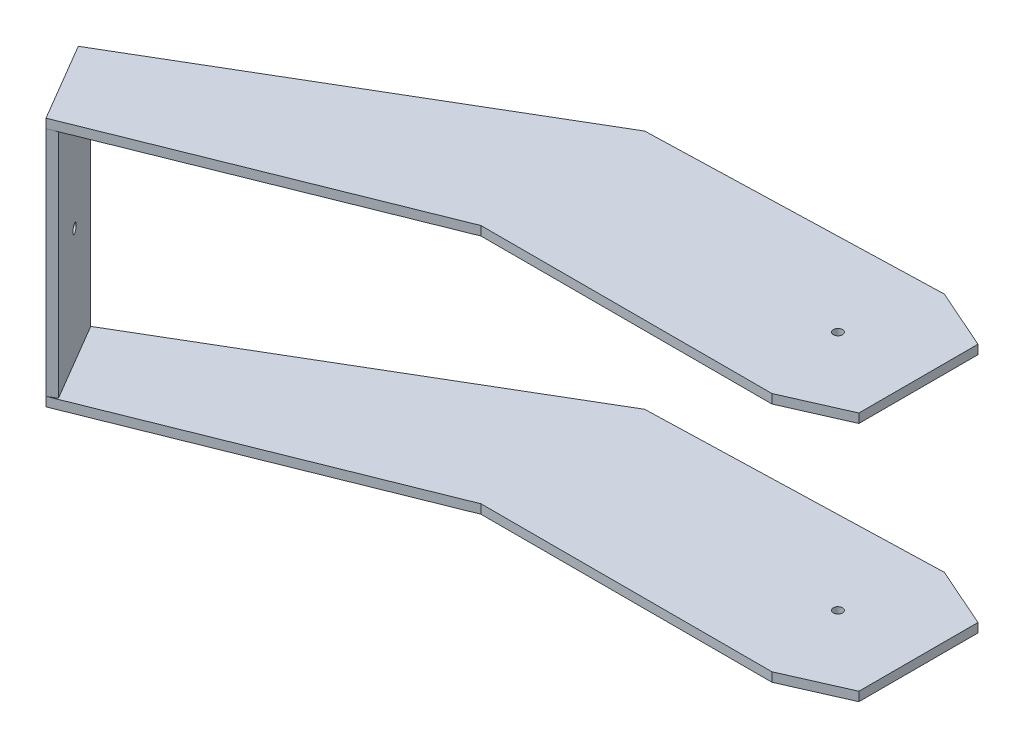
ISO-10303-21;
HEADER;
FILE_DESCRIPTION(('STEP AP214'),'2;1');
FILE_NAME('part.step','',(''),(''),'','','');
FILE_SCHEMA(('AUTOMOTIVE_DESIGN { 1 0 10303 214 1 1 1 1 }'));
ENDSEC;
DATA;
#1=APPLICATION_CONTEXT('core data for automotive mechanical design processes');
#2=APPLICATION_PROTOCOL_DEFINITION('international standard','automotive_design',2000,#1);
#3=PRODUCT_CONTEXT('',#1,'mechanical');
#4=PRODUCT('Part','Part','',(#3));
#5=PRODUCT_RELATED_PRODUCT_CATEGORY('part','',(#4));
#6=PRODUCT_DEFINITION_FORMATION('','',#4);
#7=PRODUCT_DEFINITION_CONTEXT('part definition',#1,'design');
#8=PRODUCT_DEFINITION('design','',#6,#7);
#9=PRODUCT_DEFINITION_SHAPE('','',#8);
#10=(LENGTH_UNIT() NAMED_UNIT(*) SI_UNIT(.MILLI.,.METRE.));
#11=(NAMED_UNIT(*) PLANE_ANGLE_UNIT() SI_UNIT($,.RADIAN.));
#12=(NAMED_UNIT(*) SI_UNIT($,.STERADIAN.) SOLID_ANGLE_UNIT());
#13=UNCERTAINTY_MEASURE_WITH_UNIT(LENGTH_MEASURE(1.E-05),#10,'distance_accuracy_value','');
#14=(GEOMETRIC_REPRESENTATION_CONTEXT(3) GLOBAL_UNCERTAINTY_ASSIGNED_CONTEXT((#13)) GLOBAL_UNIT_ASSIGNED_CONTEXT((#10,
#11,#12)) REPRESENTATION_CONTEXT('',''));
#15=CARTESIAN_POINT('',(0.,0.,0.));
#16=DIRECTION('',(0.,0.,1.));
#17=DIRECTION('',(1.,0.,0.));
#18=AXIS2_PLACEMENT_3D('',#15,#16,#17);
#19=CARTESIAN_POINT('',(0.,23.5,0.));
#20=DIRECTION('',(0.,0.,-1.));
#21=DIRECTION('',(-1.,0.,0.));
#22=AXIS2_PLACEMENT_3D('',#19,#20,#21);
#23=PLANE('',#22);
#24=DIRECTION('',(-1.,0.,0.));
#25=VECTOR('',#24,1.);
#26=CARTESIAN_POINT('',(0.,25.5,0.));
#27=LINE('',#26,#25);
#28=CARTESIAN_POINT('',(0.,25.5,0.));
#29=VERTEX_POINT('',#28);
#30=CARTESIAN_POINT('',(-64.,25.5000000000004,0.));
#31=VERTEX_POINT('',#30);
#32=EDGE_CURVE('E276',#29,#31,#27,.T.);
#33=ORIENTED_EDGE('',*,*,#32,.T.);
#34=DIRECTION('',(0.,1.,0.));
#35=VECTOR('',#34,1.);
#36=CARTESIAN_POINT('',(-64.,23.5000000000004,0.));
#37=LINE('',#36,#35);
#38=CARTESIAN_POINT('',(-64.,23.5000000000004,0.));
#39=VERTEX_POINT('',#38);
#40=EDGE_CURVE('E46',#39,#31,#37,.T.);
#41=ORIENTED_EDGE('',*,*,#40,.F.);
#42=DIRECTION('',(-1.,0.,0.));
#43=VECTOR('',#42,1.);
#44=CARTESIAN_POINT('',(0.,23.5,0.));
#45=LINE('',#44,#43);
#46=CARTESIAN_POINT('',(0.,23.5,0.));
#47=VERTEX_POINT('',#46);
#48=EDGE_CURVE('E280',#47,#39,#45,.T.);
#49=ORIENTED_EDGE('',*,*,#48,.F.);
#50=DIRECTION('',(0.,1.,0.));
#51=VECTOR('',#50,1.);
#52=CARTESIAN_POINT('',(0.,23.5,0.));
#53=LINE('',#52,#51);
#54=EDGE_CURVE('E304',#47,#29,#53,.T.);
#55=ORIENTED_EDGE('',*,*,#54,.T.);
#56=EDGE_LOOP('',(#33,#41,#49,#55));
#57=FACE_BOUND('',#56,.T.);
#58=ADVANCED_FACE('F38',(#57),#23,.F.);
#59=CARTESIAN_POINT('',(-132.293984031114,23.5000000000009,27.3792690487822));
#60=DIRECTION('',(-0.372113179659654,0.,-0.928187363372063));
#61=DIRECTION('',(-0.928187363372063,0.,0.372113179659654));
#62=AXIS2_PLACEMENT_3D('',#59,#60,#61);
#63=PLANE('',#62);
#64=DIRECTION('',(-0.928187363372063,0.,0.372113179659654));
#65=VECTOR('',#64,1.);
#66=CARTESIAN_POINT('',(-132.293984031114,25.5000000000009,27.3792690487822));
#67=LINE('',#66,#65);
#68=CARTESIAN_POINT('',(-132.293984031114,25.5000000000009,27.3792690487822));
#69=VERTEX_POINT('',#68);
#70=EDGE_CURVE('E308',#31,#69,#67,.T.);
#71=ORIENTED_EDGE('',*,*,#70,.T.);
#72=DIRECTION('',(0.,1.,0.));
#73=VECTOR('',#72,1.);
#74=CARTESIAN_POINT('',(-132.293984031114,23.5000000000009,27.3792690487822));
#75=LINE('',#74,#73);
#76=CARTESIAN_POINT('',(-132.293984031114,23.5000000000009,27.3792690487822));
#77=VERTEX_POINT('',#76);
#78=EDGE_CURVE('E351',#77,#69,#75,.T.);
#79=ORIENTED_EDGE('',*,*,#78,.F.);
#80=DIRECTION('',(-0.928187363372063,0.,0.372113179659654));
#81=VECTOR('',#80,1.);
#82=CARTESIAN_POINT('',(-132.293984031114,23.5000000000009,27.3792690487822));
#83=LINE('',#82,#81);
#84=EDGE_CURVE('E284',#39,#77,#83,.T.);
#85=ORIENTED_EDGE('',*,*,#84,.F.);
#86=ORIENTED_EDGE('',*,*,#40,.T.);
#87=EDGE_LOOP('',(#71,#79,#85,#86));
#88=FACE_BOUND('',#87,.T.);
#89=ADVANCED_FACE('F358',(#88),#63,.F.);
#90=CARTESIAN_POINT('',(-132.293984031114,23.5000000000009,27.3792690487822));
#91=DIRECTION('',(0.861921198917986,0.,-0.507042253521125));
#92=DIRECTION('',(-0.507042253521125,0.,-0.861921198917986));
#93=AXIS2_PLACEMENT_3D('',#90,#91,#92);
#94=PLANE('',#93);
#95=CARTESIAN_POINT('',(-137.364406566326,-1.99999999999904,18.7600570596024));
#96=DIRECTION('',(-0.861921198917986,0.,0.507042253521125));
#97=DIRECTION('',(0.507042253521126,0.,0.861921198917986));
#98=AXIS2_PLACEMENT_3D('',#95,#96,#97);
#99=CIRCLE('',#98,1.);
#100=CARTESIAN_POINT('',(-136.857364312805,-1.99999999999904,19.6219782585204));
#101=VERTEX_POINT('',#100);
#102=EDGE_CURVE('E597',#101,#101,#99,.T.);
#103=ORIENTED_EDGE('',*,*,#102,.F.);
#104=EDGE_LOOP('',(#103));
#105=FACE_BOUND('',#104,.T.);
#106=DIRECTION('',(-0.507042253521125,0.,-0.861921198917986));
#107=VECTOR('',#106,1.);
#108=CARTESIAN_POINT('',(-132.293984031114,25.5000000000009,27.3792690487822));
#109=LINE('',#108,#107);
#110=CARTESIAN_POINT('',(-142.434829101537,25.500000000001,10.1408450704225));
#111=VERTEX_POINT('',#110);
#112=EDGE_CURVE('E311',#69,#111,#109,.T.);
#113=ORIENTED_EDGE('',*,*,#112,.T.);
#114=DIRECTION('',(0.,1.,0.));
#115=VECTOR('',#114,1.);
#116=CARTESIAN_POINT('',(-142.434829101537,23.500000000001,10.1408450704225));
#117=LINE('',#116,#115);
#118=CARTESIAN_POINT('',(-142.434829101537,-29.499999999999,10.1408450704226));
#119=VERTEX_POINT('',#118);
#120=EDGE_CURVE('E348',#119,#111,#117,.T.);
#121=ORIENTED_EDGE('',*,*,#120,.F.);
#122=DIRECTION('',(0.507042253521125,0.,0.861921198917986));
#123=VECTOR('',#122,1.);
#124=CARTESIAN_POINT('',(-142.434829101537,-29.499999999999,10.1408450704226));
#125=LINE('',#124,#123);
#126=CARTESIAN_POINT('',(-132.293984031115,-29.4999999999991,27.3792690487823));
#127=VERTEX_POINT('',#126);
#128=EDGE_CURVE('E247',#119,#127,#125,.T.);
#129=ORIENTED_EDGE('',*,*,#128,.T.);
#130=DIRECTION('',(0.,1.,0.));
#131=VECTOR('',#130,1.);
#132=CARTESIAN_POINT('',(-132.293984031114,25.5000000000009,27.3792690487823));
#133=LINE('',#132,#131);
#134=CARTESIAN_POINT('',(-132.293984031115,-27.4999999999991,27.3792690487823));
#135=VERTEX_POINT('',#134);
#136=EDGE_CURVE('E252',#127,#135,#133,.T.);
#137=ORIENTED_EDGE('',*,*,#136,.T.);
#138=EDGE_CURVE('E259',#135,#77,#133,.T.);
#139=ORIENTED_EDGE('',*,*,#138,.T.);
#140=ORIENTED_EDGE('',*,*,#78,.T.);
#141=EDGE_LOOP('',(#113,#121,#129,#137,#139,#140));
#142=FACE_BOUND('',#141,.T.);
#143=ADVANCED_FACE('F373',(#105,#142),#94,.F.);
#144=CARTESIAN_POINT('',(-64.,23.5000000000004,-36.));
#145=DIRECTION('',(0.507042253521127,0.,0.861921198917985));
#146=DIRECTION('',(0.861921198917986,0.,-0.507042253521127));
#147=AXIS2_PLACEMENT_3D('',#144,#145,#146);
#148=PLANE('',#147);
#149=DIRECTION('',(0.,-1.,0.));
#150=VECTOR('',#149,1.);
#151=CARTESIAN_POINT('',(-140.710986703701,25.500000000001,9.12676056338031));
#152=LINE('',#151,#150);
#153=CARTESIAN_POINT('',(-140.710986703701,23.500000000001,9.12676056338032));
#154=VERTEX_POINT('',#153);
#155=CARTESIAN_POINT('',(-140.710986703701,-27.499999999999,9.12676056338031));
#156=VERTEX_POINT('',#155);
#157=EDGE_CURVE('E248',#154,#156,#152,.T.);
#158=ORIENTED_EDGE('',*,*,#157,.T.);
#159=DIRECTION('',(0.861921198917985,0.,-0.507042253521127));
#160=VECTOR('',#159,1.);
#161=CARTESIAN_POINT('',(-64.0000000000006,-27.4999999999996,-35.9999999999999));
#162=LINE('',#161,#160);
#163=CARTESIAN_POINT('',(-64.0000000000006,-27.4999999999996,-35.9999999999999));
#164=VERTEX_POINT('',#163);
#165=EDGE_CURVE('E171',#156,#164,#162,.T.);
#166=ORIENTED_EDGE('',*,*,#165,.T.);
#167=DIRECTION('',(0.,-1.,0.));
#168=VECTOR('',#167,1.);
#169=CARTESIAN_POINT('',(-64.0000000000006,-27.4999999999996,-35.9999999999999));
#170=LINE('',#169,#168);
#171=CARTESIAN_POINT('',(-64.0000000000006,-29.4999999999996,-35.9999999999999));
#172=VERTEX_POINT('',#171);
#173=EDGE_CURVE('E186',#164,#172,#170,.T.);
#174=ORIENTED_EDGE('',*,*,#173,.T.);
#175=DIRECTION('',(-0.861921198917986,0.,0.507042253521126));
#176=VECTOR('',#175,1.);
#177=CARTESIAN_POINT('',(-140.710986703701,-29.499999999999,9.12676056338031));
#178=LINE('',#177,#176);
#179=EDGE_CURVE('E255',#172,#119,#178,.T.);
#180=ORIENTED_EDGE('',*,*,#179,.T.);
#181=ORIENTED_EDGE('',*,*,#120,.T.);
#182=DIRECTION('',(0.861921198917985,0.,-0.507042253521127));
#183=VECTOR('',#182,1.);
#184=CARTESIAN_POINT('',(-64.,25.5000000000004,-36.));
#185=LINE('',#184,#183);
#186=CARTESIAN_POINT('',(-64.,25.5000000000004,-36.));
#187=VERTEX_POINT('',#186);
#188=EDGE_CURVE('E315',#111,#187,#185,.T.);
#189=ORIENTED_EDGE('',*,*,#188,.T.);
#190=DIRECTION('',(0.,1.,0.));
#191=VECTOR('',#190,1.);
#192=CARTESIAN_POINT('',(-64.,23.5000000000004,-36.));
#193=LINE('',#192,#191);
#194=CARTESIAN_POINT('',(-64.,23.5000000000004,-36.));
#195=VERTEX_POINT('',#194);
#196=EDGE_CURVE('E344',#195,#187,#193,.T.);
#197=ORIENTED_EDGE('',*,*,#196,.F.);
#198=DIRECTION('',(0.861921198917985,0.,-0.507042253521127));
#199=VECTOR('',#198,1.);
#200=CARTESIAN_POINT('',(-64.,23.5000000000004,-36.));
#201=LINE('',#200,#199);
#202=EDGE_CURVE('E289',#154,#195,#201,.T.);
#203=ORIENTED_EDGE('',*,*,#202,.F.);
#204=EDGE_LOOP('',(#158,#166,#174,#180,#181,#189,#197,#203));
#205=FACE_BOUND('',#204,.T.);
#206=ADVANCED_FACE('F381',(#205),#148,.F.);
#207=CARTESIAN_POINT('',(0.,23.5,-37.9064407956823));
#208=DIRECTION('',(0.0297749302206453,0.,0.999556628476024));
#209=DIRECTION('',(0.999556628476024,0.,-0.0297749302206453));
#210=AXIS2_PLACEMENT_3D('',#207,#208,#209);
#211=PLANE('',#210);
#212=DIRECTION('',(0.999556628476024,0.,-0.0297749302206453));
#213=VECTOR('',#212,1.);
#214=CARTESIAN_POINT('',(0.,25.5,-37.9064407956823));
#215=LINE('',#214,#213);
#216=CARTESIAN_POINT('',(0.,25.5,-37.9064407956823));
#217=VERTEX_POINT('',#216);
#218=EDGE_CURVE('E318',#187,#217,#215,.T.);
#219=ORIENTED_EDGE('',*,*,#218,.T.);
#220=DIRECTION('',(0.,1.,0.));
#221=VECTOR('',#220,1.);
#222=CARTESIAN_POINT('',(0.,23.5,-37.9064407956823));
#223=LINE('',#222,#221);
#224=CARTESIAN_POINT('',(0.,23.5,-37.9064407956823));
#225=VERTEX_POINT('',#224);
#226=EDGE_CURVE('E340',#225,#217,#223,.T.);
#227=ORIENTED_EDGE('',*,*,#226,.F.);
#228=DIRECTION('',(0.999556628476024,0.,-0.0297749302206453));
#229=VECTOR('',#228,1.);
#230=CARTESIAN_POINT('',(0.,23.5,-37.9064407956823));
#231=LINE('',#230,#229);
#232=EDGE_CURVE('E292',#195,#225,#231,.T.);
#233=ORIENTED_EDGE('',*,*,#232,.F.);
#234=ORIENTED_EDGE('',*,*,#196,.T.);
#235=EDGE_LOOP('',(#219,#227,#233,#234));
#236=FACE_BOUND('',#235,.T.);
#237=ADVANCED_FACE('F388',(#236),#211,.F.);
#238=CARTESIAN_POINT('',(0.,23.5,-37.9064407956823));
#239=DIRECTION('',(-0.403577522554237,0.,0.914945453723327));
#240=DIRECTION('',(0.914945453723327,0.,0.403577522554237));
#241=AXIS2_PLACEMENT_3D('',#238,#239,#240);
#242=PLANE('',#241);
#243=DIRECTION('',(0.914945453723327,0.,0.403577522554237));
#244=VECTOR('',#243,1.);
#245=CARTESIAN_POINT('',(0.,25.5,-37.9064407956823));
#246=LINE('',#245,#244);
#247=CARTESIAN_POINT('',(13.2667090789882,25.4999999999999,-32.0545667186458));
#248=VERTEX_POINT('',#247);
#249=EDGE_CURVE('E321',#217,#248,#246,.T.);
#250=ORIENTED_EDGE('',*,*,#249,.T.);
#251=DIRECTION('',(0.,1.,0.));
#252=VECTOR('',#251,1.);
#253=CARTESIAN_POINT('',(13.2667090789882,23.4999999999999,-32.0545667186458));
#254=LINE('',#253,#252);
#255=CARTESIAN_POINT('',(13.2667090789882,23.4999999999999,-32.0545667186458));
#256=VERTEX_POINT('',#255);
#257=EDGE_CURVE('E336',#256,#248,#254,.T.);
#258=ORIENTED_EDGE('',*,*,#257,.F.);
#259=DIRECTION('',(0.914945453723327,0.,0.403577522554237));
#260=VECTOR('',#259,1.);
#261=CARTESIAN_POINT('',(0.,23.5,-37.9064407956823));
#262=LINE('',#261,#260);
#263=EDGE_CURVE('E295',#225,#256,#262,.T.);
#264=ORIENTED_EDGE('',*,*,#263,.F.);
#265=ORIENTED_EDGE('',*,*,#226,.T.);
#266=EDGE_LOOP('',(#250,#258,#264,#265));
#267=FACE_BOUND('',#266,.T.);
#268=ADVANCED_FACE('F391',(#267),#242,.F.);
#269=CARTESIAN_POINT('',(13.2667090789882,23.4999999999999,-32.0545667186458));
#270=DIRECTION('',(-1.,0.,0.));
#271=DIRECTION('',(0.,-1.,0.));
#272=AXIS2_PLACEMENT_3D('',#269,#270,#271);
#273=PLANE('',#272);
#274=DIRECTION('',(0.,0.,1.));
#275=VECTOR('',#274,1.);
#276=CARTESIAN_POINT('',(13.2667090789882,25.4999999999999,-32.0545667186458));
#277=LINE('',#276,#275);
#278=CARTESIAN_POINT('',(13.2667090789882,25.4999999999999,-5.85187407703645));
#279=VERTEX_POINT('',#278);
#280=EDGE_CURVE('E324',#248,#279,#277,.T.);
#281=ORIENTED_EDGE('',*,*,#280,.T.);
#282=DIRECTION('',(0.,1.,0.));
#283=VECTOR('',#282,1.);
#284=CARTESIAN_POINT('',(13.2667090789882,23.4999999999999,-5.85187407703645));
#285=LINE('',#284,#283);
#286=CARTESIAN_POINT('',(13.2667090789882,23.4999999999999,-5.85187407703645));
#287=VERTEX_POINT('',#286);
#288=EDGE_CURVE('E332',#287,#279,#285,.T.);
#289=ORIENTED_EDGE('',*,*,#288,.F.);
#290=DIRECTION('',(0.,0.,1.));
#291=VECTOR('',#290,1.);
#292=CARTESIAN_POINT('',(13.2667090789882,23.4999999999999,-32.0545667186458));
#293=LINE('',#292,#291);
#294=EDGE_CURVE('E298',#256,#287,#293,.T.);
#295=ORIENTED_EDGE('',*,*,#294,.F.);
#296=ORIENTED_EDGE('',*,*,#257,.T.);
#297=EDGE_LOOP('',(#281,#289,#295,#296));
#298=FACE_BOUND('',#297,.T.);
#299=ADVANCED_FACE('F395',(#298),#273,.F.);
#300=CARTESIAN_POINT('',(0.,23.5,0.));
#301=DIRECTION('',(-0.403577522554238,0.,-0.914945453723326));
#302=DIRECTION('',(-0.914945453723326,0.,0.403577522554238));
#303=AXIS2_PLACEMENT_3D('',#300,#301,#302);
#304=PLANE('',#303);
#305=DIRECTION('',(-0.914945453723326,0.,0.403577522554238));
#306=VECTOR('',#305,1.);
#307=CARTESIAN_POINT('',(0.,25.5,0.));
#308=LINE('',#307,#306);
#309=EDGE_CURVE('E285',#279,#29,#308,.T.);
#310=ORIENTED_EDGE('',*,*,#309,.T.);
#311=ORIENTED_EDGE('',*,*,#54,.F.);
#312=DIRECTION('',(-0.914945453723326,0.,0.403577522554238));
#313=VECTOR('',#312,1.);
#314=CARTESIAN_POINT('',(0.,23.5,0.));
#315=LINE('',#314,#313);
#316=EDGE_CURVE('E301',#287,#47,#315,.T.);
#317=ORIENTED_EDGE('',*,*,#316,.F.);
#318=ORIENTED_EDGE('',*,*,#288,.T.);
#319=EDGE_LOOP('',(#310,#311,#317,#318));
#320=FACE_BOUND('',#319,.T.);
#321=ADVANCED_FACE('F398',(#320),#304,.F.);
#322=CARTESIAN_POINT('',(1.64358226964181E-13,23.5,0.));
#323=DIRECTION('',(0.,1.,0.));
#324=DIRECTION('',(-1.,0.,0.));
#325=AXIS2_PLACEMENT_3D('',#322,#323,#324);
#326=PLANE('',#325);
#327=CARTESIAN_POINT('',(-4.43329092101178,23.5,-18.9532203978411));
#328=DIRECTION('',(0.,-1.,0.));
#329=DIRECTION('',(1.,0.,0.));
#330=AXIS2_PLACEMENT_3D('',#327,#328,#329);
#331=CIRCLE('',#330,1.);
#332=CARTESIAN_POINT('',(-3.43329092101178,23.5,-18.9532203978411));
#333=VERTEX_POINT('',#332);
#334=EDGE_CURVE('E272',#333,#333,#331,.T.);
#335=ORIENTED_EDGE('',*,*,#334,.F.);
#336=EDGE_LOOP('',(#335));
#337=FACE_BOUND('',#336,.T.);
#338=ORIENTED_EDGE('',*,*,#84,.T.);
#339=DIRECTION('',(0.861921198917986,0.,-0.507042253521125));
#340=VECTOR('',#339,1.);
#341=CARTESIAN_POINT('',(-22.0461299423995,23.5000000000002,-37.4762194264805));
#342=LINE('',#341,#340);
#343=CARTESIAN_POINT('',(-130.570141633278,23.5000000000009,26.36518454174));
#344=VERTEX_POINT('',#343);
#345=EDGE_CURVE('E268',#77,#344,#342,.T.);
#346=ORIENTED_EDGE('',*,*,#345,.T.);
#347=DIRECTION('',(0.507042253521125,0.,0.861921198917986));
#348=VECTOR('',#347,1.);
#349=CARTESIAN_POINT('',(-108.524011690879,23.5000000000008,63.8414039682205));
#350=LINE('',#349,#348);
#351=EDGE_CURVE('E60',#154,#344,#350,.T.);
#352=ORIENTED_EDGE('',*,*,#351,.F.);
#353=ORIENTED_EDGE('',*,*,#202,.T.);
#354=ORIENTED_EDGE('',*,*,#232,.T.);
#355=ORIENTED_EDGE('',*,*,#263,.T.);
#356=ORIENTED_EDGE('',*,*,#294,.T.);
#357=ORIENTED_EDGE('',*,*,#316,.T.);
#358=ORIENTED_EDGE('',*,*,#48,.T.);
#359=EDGE_LOOP('',(#338,#346,#352,#353,#354,#355,#356,#357,#358));
#360=FACE_BOUND('',#359,.T.);
#361=ADVANCED_FACE('F376',(#337,#360),#326,.F.);
#362=CARTESIAN_POINT('',(1.78324152319553E-13,25.5,0.));
#363=DIRECTION('',(0.,1.,0.));
#364=DIRECTION('',(-1.,0.,0.));
#365=AXIS2_PLACEMENT_3D('',#362,#363,#364);
#366=PLANE('',#365);
#367=ORIENTED_EDGE('',*,*,#112,.F.);
#368=ORIENTED_EDGE('',*,*,#70,.F.);
#369=ORIENTED_EDGE('',*,*,#32,.F.);
#370=ORIENTED_EDGE('',*,*,#309,.F.);
#371=ORIENTED_EDGE('',*,*,#280,.F.);
#372=ORIENTED_EDGE('',*,*,#249,.F.);
#373=ORIENTED_EDGE('',*,*,#218,.F.);
#374=ORIENTED_EDGE('',*,*,#188,.F.);
#375=EDGE_LOOP('',(#367,#368,#369,#370,#371,#372,#373,#374));
#376=FACE_BOUND('',#375,.T.);
#377=CARTESIAN_POINT('',(-4.43329092101176,25.5,-18.9532203978411));
#378=DIRECTION('',(0.,-1.,0.));
#379=DIRECTION('',(1.,0.,0.));
#380=AXIS2_PLACEMENT_3D('',#377,#378,#379);
#381=CIRCLE('',#380,1.);
#382=CARTESIAN_POINT('',(-3.43329092101176,25.5,-18.9532203978411));
#383=VERTEX_POINT('',#382);
#384=EDGE_CURVE('E271',#383,#383,#381,.T.);
#385=ORIENTED_EDGE('',*,*,#384,.T.);
#386=EDGE_LOOP('',(#385));
#387=FACE_BOUND('',#386,.T.);
#388=ADVANCED_FACE('F367',(#376,#387),#366,.T.);
#389=CARTESIAN_POINT('',(-4.43329092101178,23.5,-18.9532203978411));
#390=DIRECTION('',(0.,1.,0.));
#391=DIRECTION('',(-1.,0.,0.));
#392=AXIS2_PLACEMENT_3D('',#389,#390,#391);
#393=CYLINDRICAL_SURFACE('',#392,1.);
#394=ORIENTED_EDGE('',*,*,#334,.T.);
#395=EDGE_LOOP('',(#394));
#396=FACE_BOUND('',#395,.T.);
#397=ORIENTED_EDGE('',*,*,#384,.F.);
#398=EDGE_LOOP('',(#397));
#399=FACE_BOUND('',#398,.T.);
#400=ADVANCED_FACE('F443',(#396,#399),#393,.F.);
#401=CARTESIAN_POINT('',(-130.570141633278,25.5000000000009,26.36518454174));
#402=DIRECTION('',(0.507042253521126,0.,0.861921198917986));
#403=DIRECTION('',(0.861921198917986,0.,-0.507042253521125));
#404=AXIS2_PLACEMENT_3D('',#401,#402,#403);
#405=PLANE('',#404);
#406=DIRECTION('',(-0.861921198917986,0.,0.507042253521125));
#407=VECTOR('',#406,1.);
#408=CARTESIAN_POINT('',(-130.570141633279,-27.4999999999991,26.36518454174));
#409=LINE('',#408,#407);
#410=CARTESIAN_POINT('',(-130.570141633279,-27.4999999999991,26.36518454174));
#411=VERTEX_POINT('',#410);
#412=EDGE_CURVE('E233',#411,#135,#409,.T.);
#413=ORIENTED_EDGE('',*,*,#412,.F.);
#414=DIRECTION('',(0.,1.,0.));
#415=VECTOR('',#414,1.);
#416=CARTESIAN_POINT('',(-130.570141633278,25.5000000000009,26.36518454174));
#417=LINE('',#416,#415);
#418=EDGE_CURVE('E53',#411,#344,#417,.T.);
#419=ORIENTED_EDGE('',*,*,#418,.T.);
#420=ORIENTED_EDGE('',*,*,#345,.F.);
#421=ORIENTED_EDGE('',*,*,#138,.F.);
#422=EDGE_LOOP('',(#413,#419,#420,#421));
#423=FACE_BOUND('',#422,.T.);
#424=ADVANCED_FACE('F375',(#423),#405,.T.);
#425=CARTESIAN_POINT('',(-108.524011690879,7.66869693031554E-13,63.8414039682205));
#426=DIRECTION('',(-0.861921198917986,0.,0.507042253521125));
#427=DIRECTION('',(0.507042253521125,0.,0.861921198917986));
#428=AXIS2_PLACEMENT_3D('',#425,#426,#427);
#429=PLANE('',#428);
#430=CARTESIAN_POINT('',(-135.64056416849,-1.99999999999905,17.7459725525602));
#431=DIRECTION('',(-0.861921198917986,0.,0.507042253521125));
#432=DIRECTION('',(0.507042253521126,0.,0.861921198917986));
#433=AXIS2_PLACEMENT_3D('',#430,#431,#432);
#434=CIRCLE('',#433,1.);
#435=CARTESIAN_POINT('',(-135.133521914969,-1.99999999999905,18.6078937514782));
#436=VERTEX_POINT('',#435);
#437=EDGE_CURVE('E594',#436,#436,#434,.T.);
#438=ORIENTED_EDGE('',*,*,#437,.T.);
#439=EDGE_LOOP('',(#438));
#440=FACE_BOUND('',#439,.T.);
#441=ORIENTED_EDGE('',*,*,#418,.F.);
#442=DIRECTION('',(-0.507042253521125,0.,-0.861921198917986));
#443=VECTOR('',#442,1.);
#444=CARTESIAN_POINT('',(-108.524011690879,-27.4999999999993,63.8414039682205));
#445=LINE('',#444,#443);
#446=EDGE_CURVE('E11',#411,#156,#445,.T.);
#447=ORIENTED_EDGE('',*,*,#446,.T.);
#448=ORIENTED_EDGE('',*,*,#157,.F.);
#449=ORIENTED_EDGE('',*,*,#351,.T.);
#450=EDGE_LOOP('',(#441,#447,#448,#449));
#451=FACE_BOUND('',#450,.T.);
#452=ADVANCED_FACE('F379',(#440,#451),#429,.F.);
#453=CARTESIAN_POINT('',(-140.710986703701,-29.499999999999,9.12676056338031));
#454=DIRECTION('',(0.,-1.,0.));
#455=DIRECTION('',(1.,0.,0.));
#456=AXIS2_PLACEMENT_3D('',#453,#454,#455);
#457=PLANE('',#456);
#458=CARTESIAN_POINT('',(-4.43329092101215,-29.5,-18.9532203978411));
#459=DIRECTION('',(0.,-1.,0.));
#460=DIRECTION('',(1.,0.,0.));
#461=AXIS2_PLACEMENT_3D('',#458,#459,#460);
#462=CIRCLE('',#461,0.999999999999998);
#463=CARTESIAN_POINT('',(-3.43329092101216,-29.5,-18.9532203978411));
#464=VERTEX_POINT('',#463);
#465=EDGE_CURVE('E195',#464,#464,#462,.T.);
#466=ORIENTED_EDGE('',*,*,#465,.F.);
#467=EDGE_LOOP('',(#466));
#468=FACE_BOUND('',#467,.T.);
#469=DIRECTION('',(-0.928187363372063,0.,0.372113179659654));
#470=VECTOR('',#469,1.);
#471=CARTESIAN_POINT('',(-132.293984031115,-29.4999999999991,27.3792690487823));
#472=LINE('',#471,#470);
#473=CARTESIAN_POINT('',(-64.0000000000005,-29.4999999999996,0.));
#474=VERTEX_POINT('',#473);
#475=EDGE_CURVE('E188',#474,#127,#472,.T.);
#476=ORIENTED_EDGE('',*,*,#475,.T.);
#477=ORIENTED_EDGE('',*,*,#128,.F.);
#478=ORIENTED_EDGE('',*,*,#179,.F.);
#479=DIRECTION('',(0.999556628476024,0.,-0.0297749302206452));
#480=VECTOR('',#479,1.);
#481=CARTESIAN_POINT('',(-5.12838342335071E-13,-29.5,-37.9064407956822));
#482=LINE('',#481,#480);
#483=CARTESIAN_POINT('',(-5.12838342335071E-13,-29.5,-37.9064407956822));
#484=VERTEX_POINT('',#483);
#485=EDGE_CURVE('E214',#172,#484,#482,.T.);
#486=ORIENTED_EDGE('',*,*,#485,.T.);
#487=DIRECTION('',(0.914945453723327,0.,0.403577522554237));
#488=VECTOR('',#487,1.);
#489=CARTESIAN_POINT('',(-5.12838342335071E-13,-29.5,-37.9064407956822));
#490=LINE('',#489,#488);
#491=CARTESIAN_POINT('',(13.2667090789877,-29.5000000000001,-32.0545667186457));
#492=VERTEX_POINT('',#491);
#493=EDGE_CURVE('E164',#484,#492,#490,.T.);
#494=ORIENTED_EDGE('',*,*,#493,.T.);
#495=DIRECTION('',(0.,0.,1.));
#496=VECTOR('',#495,1.);
#497=CARTESIAN_POINT('',(13.2667090789877,-29.5000000000001,-32.0545667186457));
#498=LINE('',#497,#496);
#499=CARTESIAN_POINT('',(13.2667090789877,-29.5000000000001,-5.85187407703638));
#500=VERTEX_POINT('',#499);
#501=EDGE_CURVE('E220',#492,#500,#498,.T.);
#502=ORIENTED_EDGE('',*,*,#501,.T.);
#503=DIRECTION('',(-0.914945453723327,0.,0.403577522554236));
#504=VECTOR('',#503,1.);
#505=CARTESIAN_POINT('',(-5.12838342335071E-13,-29.5,0.));
#506=LINE('',#505,#504);
#507=CARTESIAN_POINT('',(-5.12838342335071E-13,-29.5,0.));
#508=VERTEX_POINT('',#507);
#509=EDGE_CURVE('E224',#500,#508,#506,.T.);
#510=ORIENTED_EDGE('',*,*,#509,.T.);
#511=DIRECTION('',(-1.,0.,0.));
#512=VECTOR('',#511,1.);
#513=CARTESIAN_POINT('',(-5.12838342335071E-13,-29.5,0.));
#514=LINE('',#513,#512);
#515=EDGE_CURVE('E192',#508,#474,#514,.T.);
#516=ORIENTED_EDGE('',*,*,#515,.T.);
#517=EDGE_LOOP('',(#476,#477,#478,#486,#494,#502,#510,#516));
#518=FACE_BOUND('',#517,.T.);
#519=ADVANCED_FACE('F496',(#468,#518),#457,.T.);
#520=CARTESIAN_POINT('',(-4.98768714500281E-13,-27.5,-37.9064407956822));
#521=DIRECTION('',(-0.0297749302206452,0.,-0.999556628476024));
#522=DIRECTION('',(-0.999556628476024,0.,0.0297749302206452));
#523=AXIS2_PLACEMENT_3D('',#520,#521,#522);
#524=PLANE('',#523);
#525=ORIENTED_EDGE('',*,*,#485,.F.);
#526=ORIENTED_EDGE('',*,*,#173,.F.);
#527=DIRECTION('',(0.999556628476024,0.,-0.0297749302206452));
#528=VECTOR('',#527,1.);
#529=CARTESIAN_POINT('',(-4.98768714500281E-13,-27.5,-37.9064407956822));
#530=LINE('',#529,#528);
#531=CARTESIAN_POINT('',(-4.98768714500281E-13,-27.5,-37.9064407956822));
#532=VERTEX_POINT('',#531);
#533=EDGE_CURVE('E177',#164,#532,#530,.T.);
#534=ORIENTED_EDGE('',*,*,#533,.T.);
#535=DIRECTION('',(0.,-1.,0.));
#536=VECTOR('',#535,1.);
#537=CARTESIAN_POINT('',(-4.98768714500281E-13,-27.5,-37.9064407956822));
#538=LINE('',#537,#536);
#539=EDGE_CURVE('E159',#532,#484,#538,.T.);
#540=ORIENTED_EDGE('',*,*,#539,.T.);
#541=EDGE_LOOP('',(#525,#526,#534,#540));
#542=FACE_BOUND('',#541,.T.);
#543=ADVANCED_FACE('F184',(#542),#524,.T.);
#544=CARTESIAN_POINT('',(-132.293984031115,-27.4999999999991,27.3792690487823));
#545=DIRECTION('',(0.372113179659654,0.,0.928187363372063));
#546=DIRECTION('',(0.928187363372063,0.,-0.372113179659654));
#547=AXIS2_PLACEMENT_3D('',#544,#545,#546);
#548=PLANE('',#547);
#549=ORIENTED_EDGE('',*,*,#475,.F.);
#550=DIRECTION('',(0.,-1.,0.));
#551=VECTOR('',#550,1.);
#552=CARTESIAN_POINT('',(-64.0000000000005,-27.4999999999996,0.));
#553=LINE('',#552,#551);
#554=CARTESIAN_POINT('',(-64.0000000000005,-27.4999999999996,0.));
#555=VERTEX_POINT('',#554);
#556=EDGE_CURVE('E234',#555,#474,#553,.T.);
#557=ORIENTED_EDGE('',*,*,#556,.F.);
#558=DIRECTION('',(-0.928187363372063,0.,0.372113179659654));
#559=VECTOR('',#558,1.);
#560=CARTESIAN_POINT('',(-132.293984031115,-27.4999999999991,27.3792690487823));
#561=LINE('',#560,#559);
#562=EDGE_CURVE('E208',#555,#135,#561,.T.);
#563=ORIENTED_EDGE('',*,*,#562,.T.);
#564=ORIENTED_EDGE('',*,*,#136,.F.);
#565=EDGE_LOOP('',(#549,#557,#563,#564));
#566=FACE_BOUND('',#565,.T.);
#567=ADVANCED_FACE('F495',(#566),#548,.T.);
#568=CARTESIAN_POINT('',(-4.98768714500281E-13,-27.5,0.));
#569=DIRECTION('',(0.,0.,1.));
#570=DIRECTION('',(0.,-1.,0.));
#571=AXIS2_PLACEMENT_3D('',#568,#569,#570);
#572=PLANE('',#571);
#573=ORIENTED_EDGE('',*,*,#515,.F.);
#574=DIRECTION('',(0.,-1.,0.));
#575=VECTOR('',#574,1.);
#576=CARTESIAN_POINT('',(-4.98768714500281E-13,-27.5,0.));
#577=LINE('',#576,#575);
#578=CARTESIAN_POINT('',(-4.98768714500281E-13,-27.5,0.));
#579=VERTEX_POINT('',#578);
#580=EDGE_CURVE('E237',#579,#508,#577,.T.);
#581=ORIENTED_EDGE('',*,*,#580,.F.);
#582=DIRECTION('',(-1.,0.,0.));
#583=VECTOR('',#582,1.);
#584=CARTESIAN_POINT('',(-4.98768714500281E-13,-27.5,0.));
#585=LINE('',#584,#583);
#586=EDGE_CURVE('E204',#579,#555,#585,.T.);
#587=ORIENTED_EDGE('',*,*,#586,.T.);
#588=ORIENTED_EDGE('',*,*,#556,.T.);
#589=EDGE_LOOP('',(#573,#581,#587,#588));
#590=FACE_BOUND('',#589,.T.);
#591=ADVANCED_FACE('F506',(#590),#572,.T.);
#592=CARTESIAN_POINT('',(-4.98768714500281E-13,-27.5,0.));
#593=DIRECTION('',(0.403577522554236,0.,0.914945453723327));
#594=DIRECTION('',(0.914945453723327,0.,-0.403577522554236));
#595=AXIS2_PLACEMENT_3D('',#592,#593,#594);
#596=PLANE('',#595);
#597=ORIENTED_EDGE('',*,*,#509,.F.);
#598=DIRECTION('',(0.,-1.,0.));
#599=VECTOR('',#598,1.);
#600=CARTESIAN_POINT('',(13.2667090789877,-27.5000000000001,-5.85187407703638));
#601=LINE('',#600,#599);
#602=CARTESIAN_POINT('',(13.2667090789877,-27.5000000000001,-5.85187407703638));
#603=VERTEX_POINT('',#602);
#604=EDGE_CURVE('E240',#603,#500,#601,.T.);
#605=ORIENTED_EDGE('',*,*,#604,.F.);
#606=DIRECTION('',(-0.914945453723327,0.,0.403577522554236));
#607=VECTOR('',#606,1.);
#608=CARTESIAN_POINT('',(-4.98768714500281E-13,-27.5,0.));
#609=LINE('',#608,#607);
#610=EDGE_CURVE('E200',#603,#579,#609,.T.);
#611=ORIENTED_EDGE('',*,*,#610,.T.);
#612=ORIENTED_EDGE('',*,*,#580,.T.);
#613=EDGE_LOOP('',(#597,#605,#611,#612));
#614=FACE_BOUND('',#613,.T.);
#615=ADVANCED_FACE('F516',(#614),#596,.T.);
#616=CARTESIAN_POINT('',(13.2667090789877,-27.5000000000001,-32.0545667186457));
#617=DIRECTION('',(1.,0.,0.));
#618=DIRECTION('',(0.,1.,0.));
#619=AXIS2_PLACEMENT_3D('',#616,#617,#618);
#620=PLANE('',#619);
#621=ORIENTED_EDGE('',*,*,#501,.F.);
#622=DIRECTION('',(0.,-1.,0.));
#623=VECTOR('',#622,1.);
#624=CARTESIAN_POINT('',(13.2667090789877,-27.5000000000001,-32.0545667186457));
#625=LINE('',#624,#623);
#626=CARTESIAN_POINT('',(13.2667090789877,-27.5000000000001,-32.0545667186457));
#627=VERTEX_POINT('',#626);
#628=EDGE_CURVE('E170',#627,#492,#625,.T.);
#629=ORIENTED_EDGE('',*,*,#628,.F.);
#630=DIRECTION('',(0.,0.,1.));
#631=VECTOR('',#630,1.);
#632=CARTESIAN_POINT('',(13.2667090789877,-27.5000000000001,-32.0545667186457));
#633=LINE('',#632,#631);
#634=EDGE_CURVE('E180',#627,#603,#633,.T.);
#635=ORIENTED_EDGE('',*,*,#634,.T.);
#636=ORIENTED_EDGE('',*,*,#604,.T.);
#637=EDGE_LOOP('',(#621,#629,#635,#636));
#638=FACE_BOUND('',#637,.T.);
#639=ADVANCED_FACE('F526',(#638),#620,.T.);
#640=CARTESIAN_POINT('',(-4.98768714500281E-13,-27.5,-37.9064407956822));
#641=DIRECTION('',(0.403577522554237,0.,-0.914945453723327));
#642=DIRECTION('',(-0.914945453723327,0.,-0.403577522554237));
#643=AXIS2_PLACEMENT_3D('',#640,#641,#642);
#644=PLANE('',#643);
#645=ORIENTED_EDGE('',*,*,#493,.F.);
#646=ORIENTED_EDGE('',*,*,#539,.F.);
#647=DIRECTION('',(0.914945453723327,0.,0.403577522554237));
#648=VECTOR('',#647,1.);
#649=CARTESIAN_POINT('',(-4.98768714500281E-13,-27.5,-37.9064407956822));
#650=LINE('',#649,#648);
#651=EDGE_CURVE('E162',#532,#627,#650,.T.);
#652=ORIENTED_EDGE('',*,*,#651,.T.);
#653=ORIENTED_EDGE('',*,*,#628,.T.);
#654=EDGE_LOOP('',(#645,#646,#652,#653));
#655=FACE_BOUND('',#654,.T.);
#656=ADVANCED_FACE('F161',(#655),#644,.T.);
#657=CARTESIAN_POINT('',(-1.93942492304146E-13,-27.5,0.));
#658=DIRECTION('',(0.,1.,0.));
#659=DIRECTION('',(-1.,0.,0.));
#660=AXIS2_PLACEMENT_3D('',#657,#658,#659);
#661=PLANE('',#660);
#662=CARTESIAN_POINT('',(-4.43329092101214,-27.5,-18.9532203978411));
#663=DIRECTION('',(0.,-1.,0.));
#664=DIRECTION('',(1.,0.,0.));
#665=AXIS2_PLACEMENT_3D('',#662,#663,#664);
#666=CIRCLE('',#665,0.999999999999998);
#667=CARTESIAN_POINT('',(-3.43329092101214,-27.5,-18.9532203978411));
#668=VERTEX_POINT('',#667);
#669=EDGE_CURVE('E217',#668,#668,#666,.T.);
#670=ORIENTED_EDGE('',*,*,#669,.T.);
#671=EDGE_LOOP('',(#670));
#672=FACE_BOUND('',#671,.T.);
#673=ORIENTED_EDGE('',*,*,#446,.F.);
#674=ORIENTED_EDGE('',*,*,#412,.T.);
#675=ORIENTED_EDGE('',*,*,#562,.F.);
#676=ORIENTED_EDGE('',*,*,#586,.F.);
#677=ORIENTED_EDGE('',*,*,#610,.F.);
#678=ORIENTED_EDGE('',*,*,#634,.F.);
#679=ORIENTED_EDGE('',*,*,#651,.F.);
#680=ORIENTED_EDGE('',*,*,#533,.F.);
#681=ORIENTED_EDGE('',*,*,#165,.F.);
#682=EDGE_LOOP('',(#673,#674,#675,#676,#677,#678,#679,#680,#681));
#683=FACE_BOUND('',#682,.T.);
#684=ADVANCED_FACE('F176',(#672,#683),#661,.T.);
#685=CARTESIAN_POINT('',(-4.43329092101214,-27.5,-18.9532203978411));
#686=DIRECTION('',(0.,-1.,0.));
#687=DIRECTION('',(1.,0.,0.));
#688=AXIS2_PLACEMENT_3D('',#685,#686,#687);
#689=CYLINDRICAL_SURFACE('',#688,0.999999999999998);
#690=ORIENTED_EDGE('',*,*,#669,.F.);
#691=EDGE_LOOP('',(#690));
#692=FACE_BOUND('',#691,.T.);
#693=ORIENTED_EDGE('',*,*,#465,.T.);
#694=EDGE_LOOP('',(#693));
#695=FACE_BOUND('',#694,.T.);
#696=ADVANCED_FACE('F560',(#692,#695),#689,.F.);
#697=CARTESIAN_POINT('',(-135.64056416849,-1.99999999999905,17.7459725525602));
#698=DIRECTION('',(-0.861921198917986,0.,0.507042253521126));
#699=DIRECTION('',(0.507042253521125,0.,0.861921198917986));
#700=AXIS2_PLACEMENT_3D('',#697,#698,#699);
#701=CYLINDRICAL_SURFACE('',#700,1.);
#702=ORIENTED_EDGE('',*,*,#437,.F.);
#703=EDGE_LOOP('',(#702));
#704=FACE_BOUND('',#703,.T.);
#705=ORIENTED_EDGE('',*,*,#102,.T.);
#706=EDGE_LOOP('',(#705));
#707=FACE_BOUND('',#706,.T.);
#708=ADVANCED_FACE('F569',(#704,#707),#701,.F.);
#709=CLOSED_SHELL('',(#58,#89,#143,#206,#237,#268,#299,#321,#361,#388,#400,#424,#452,#519,#543,
#567,#591,#615,#639,#656,#684,#696,#708));
#710=MANIFOLD_SOLID_BREP('B2',#709);
#711=ADVANCED_BREP_SHAPE_REPRESENTATION('',(#18,#710),#14);
#712=SHAPE_DEFINITION_REPRESENTATION(#9,#711);
ENDSEC;
END-ISO-10303-21;
